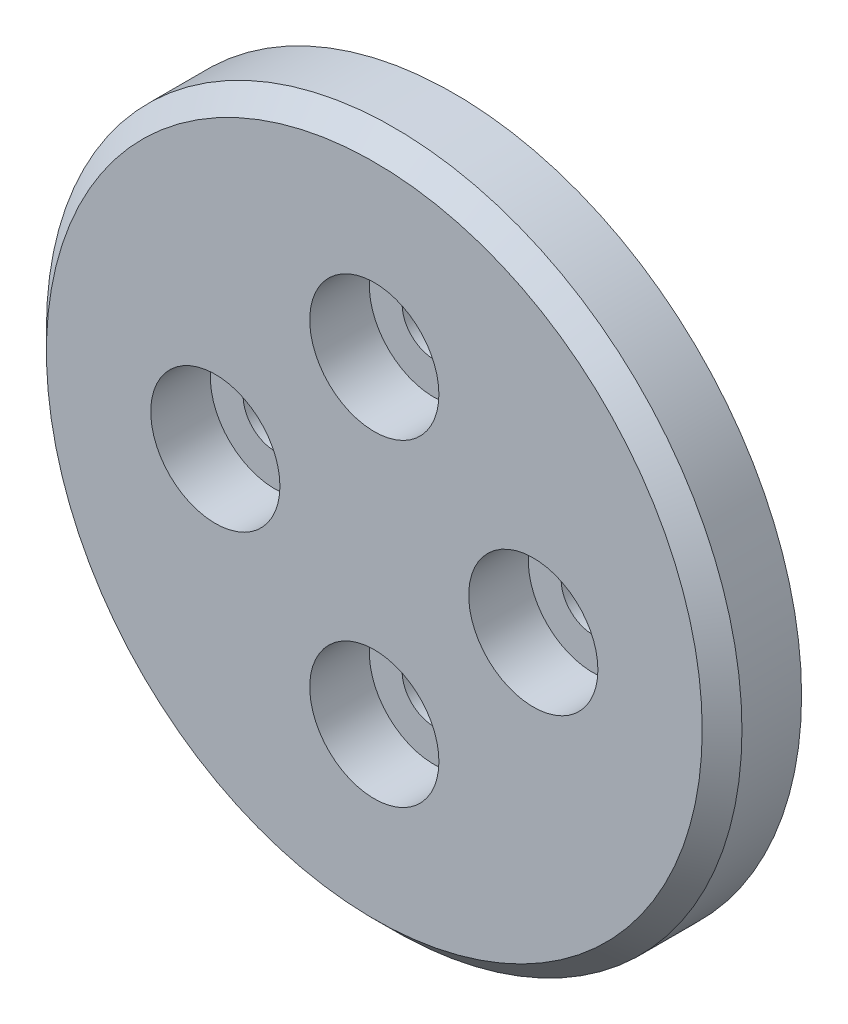
ISO-10303-21;
HEADER;
FILE_DESCRIPTION(('STEP AP214'),'2;1');
FILE_NAME('part.step','',(''),(''),'','','');
FILE_SCHEMA(('AUTOMOTIVE_DESIGN { 1 0 10303 214 1 1 1 1 }'));
ENDSEC;
DATA;
#1=APPLICATION_CONTEXT('core data for automotive mechanical design processes');
#2=APPLICATION_PROTOCOL_DEFINITION('international standard','automotive_design',2000,#1);
#3=PRODUCT_CONTEXT('',#1,'mechanical');
#4=PRODUCT('Part','Part','',(#3));
#5=PRODUCT_RELATED_PRODUCT_CATEGORY('part','',(#4));
#6=PRODUCT_DEFINITION_FORMATION('','',#4);
#7=PRODUCT_DEFINITION_CONTEXT('part definition',#1,'design');
#8=PRODUCT_DEFINITION('design','',#6,#7);
#9=PRODUCT_DEFINITION_SHAPE('','',#8);
#10=(LENGTH_UNIT() NAMED_UNIT(*) SI_UNIT(.MILLI.,.METRE.));
#11=(NAMED_UNIT(*) PLANE_ANGLE_UNIT() SI_UNIT($,.RADIAN.));
#12=(NAMED_UNIT(*) SI_UNIT($,.STERADIAN.) SOLID_ANGLE_UNIT());
#13=UNCERTAINTY_MEASURE_WITH_UNIT(LENGTH_MEASURE(1.E-05),#10,'distance_accuracy_value','');
#14=(GEOMETRIC_REPRESENTATION_CONTEXT(3) GLOBAL_UNCERTAINTY_ASSIGNED_CONTEXT((#13)) GLOBAL_UNIT_ASSIGNED_CONTEXT((#10,
#11,#12)) REPRESENTATION_CONTEXT('',''));
#15=CARTESIAN_POINT('',(0.,0.,0.));
#16=DIRECTION('',(0.,0.,1.));
#17=DIRECTION('',(1.,0.,0.));
#18=AXIS2_PLACEMENT_3D('',#15,#16,#17);
#19=CARTESIAN_POINT('',(0.,0.,4.));
#20=DIRECTION('',(0.,0.,-1.));
#21=DIRECTION('',(-1.,0.,0.));
#22=AXIS2_PLACEMENT_3D('',#19,#20,#21);
#23=CYLINDRICAL_SURFACE('',#22,17.5);
#24=CARTESIAN_POINT('',(0.,0.,3.));
#25=DIRECTION('',(0.,0.,1.));
#26=DIRECTION('',(1.,0.,0.));
#27=AXIS2_PLACEMENT_3D('',#24,#25,#26);
#28=CIRCLE('',#27,17.5);
#29=CARTESIAN_POINT('',(17.5,0.,3.));
#30=VERTEX_POINT('',#29);
#31=EDGE_CURVE('E10',#30,#30,#28,.F.);
#32=ORIENTED_EDGE('',*,*,#31,.T.);
#33=EDGE_LOOP('',(#32));
#34=FACE_BOUND('',#33,.T.);
#35=CARTESIAN_POINT('',(0.,0.,0.));
#36=DIRECTION('',(0.,0.,1.));
#37=DIRECTION('',(1.,0.,0.));
#38=AXIS2_PLACEMENT_3D('',#35,#36,#37);
#39=CIRCLE('',#38,17.5);
#40=CARTESIAN_POINT('',(17.5,0.,0.));
#41=VERTEX_POINT('',#40);
#42=EDGE_CURVE('E49',#41,#41,#39,.T.);
#43=ORIENTED_EDGE('',*,*,#42,.T.);
#44=EDGE_LOOP('',(#43));
#45=FACE_BOUND('',#44,.T.);
#46=ADVANCED_FACE('F33',(#34,#45),#23,.T.);
#47=CARTESIAN_POINT('',(0.,0.,4.));
#48=DIRECTION('',(0.,0.,1.));
#49=DIRECTION('',(1.,0.,0.));
#50=AXIS2_PLACEMENT_3D('',#47,#48,#49);
#51=PLANE('',#50);
#52=CARTESIAN_POINT('',(0.,0.,4.));
#53=DIRECTION('',(0.,0.,1.));
#54=DIRECTION('',(1.,0.,0.));
#55=AXIS2_PLACEMENT_3D('',#52,#53,#54);
#56=CIRCLE('',#55,16.5);
#57=CARTESIAN_POINT('',(16.5,0.,4.));
#58=VERTEX_POINT('',#57);
#59=EDGE_CURVE('E41',#58,#58,#56,.T.);
#60=ORIENTED_EDGE('',*,*,#59,.T.);
#61=EDGE_LOOP('',(#60));
#62=FACE_BOUND('',#61,.T.);
#63=CARTESIAN_POINT('',(0.,8.,4.));
#64=DIRECTION('',(0.,0.,1.));
#65=DIRECTION('',(1.,0.,0.));
#66=AXIS2_PLACEMENT_3D('',#63,#64,#65);
#67=CIRCLE('',#66,3.25);
#68=CARTESIAN_POINT('',(3.25,8.,4.));
#69=VERTEX_POINT('',#68);
#70=EDGE_CURVE('E102',#69,#69,#67,.T.);
#71=ORIENTED_EDGE('',*,*,#70,.F.);
#72=EDGE_LOOP('',(#71));
#73=FACE_BOUND('',#72,.T.);
#74=CARTESIAN_POINT('',(8.00000000000023,2.25918704863878E-13,4.));
#75=DIRECTION('',(0.,0.,1.));
#76=DIRECTION('',(1.,0.,0.));
#77=AXIS2_PLACEMENT_3D('',#74,#75,#76);
#78=CIRCLE('',#77,3.25);
#79=CARTESIAN_POINT('',(11.2500000000002,2.25918704863878E-13,4.));
#80=VERTEX_POINT('',#79);
#81=EDGE_CURVE('E90',#80,#80,#78,.T.);
#82=ORIENTED_EDGE('',*,*,#81,.F.);
#83=EDGE_LOOP('',(#82));
#84=FACE_BOUND('',#83,.T.);
#85=CARTESIAN_POINT('',(4.51837409727755E-13,-8.,4.));
#86=DIRECTION('',(0.,0.,1.));
#87=DIRECTION('',(1.,0.,0.));
#88=AXIS2_PLACEMENT_3D('',#85,#86,#87);
#89=CIRCLE('',#88,3.25);
#90=CARTESIAN_POINT('',(3.25000000000045,-8.,4.));
#91=VERTEX_POINT('',#90);
#92=EDGE_CURVE('E78',#91,#91,#89,.T.);
#93=ORIENTED_EDGE('',*,*,#92,.F.);
#94=EDGE_LOOP('',(#93));
#95=FACE_BOUND('',#94,.T.);
#96=CARTESIAN_POINT('',(-7.99999999999977,-2.2493898742456E-13,4.));
#97=DIRECTION('',(0.,0.,1.));
#98=DIRECTION('',(1.,0.,0.));
#99=AXIS2_PLACEMENT_3D('',#96,#97,#98);
#100=CIRCLE('',#99,3.25);
#101=CARTESIAN_POINT('',(-4.74999999999978,-2.2493898742456E-13,4.));
#102=VERTEX_POINT('',#101);
#103=EDGE_CURVE('E66',#102,#102,#100,.T.);
#104=ORIENTED_EDGE('',*,*,#103,.F.);
#105=EDGE_LOOP('',(#104));
#106=FACE_BOUND('',#105,.T.);
#107=ADVANCED_FACE('F108',(#62,#73,#84,#95,#106),#51,.T.);
#108=CARTESIAN_POINT('',(0.,0.,0.));
#109=DIRECTION('',(0.,0.,1.));
#110=DIRECTION('',(1.,0.,0.));
#111=AXIS2_PLACEMENT_3D('',#108,#109,#110);
#112=PLANE('',#111);
#113=CARTESIAN_POINT('',(0.,0.,0.));
#114=DIRECTION('',(0.,0.,-1.));
#115=DIRECTION('',(-1.,0.,0.));
#116=AXIS2_PLACEMENT_3D('',#113,#114,#115);
#117=CIRCLE('',#116,12.);
#118=CARTESIAN_POINT('',(-12.,0.,0.));
#119=VERTEX_POINT('',#118);
#120=EDGE_CURVE('E45',#119,#119,#117,.T.);
#121=ORIENTED_EDGE('',*,*,#120,.F.);
#122=EDGE_LOOP('',(#121));
#123=FACE_BOUND('',#122,.T.);
#124=ORIENTED_EDGE('',*,*,#42,.F.);
#125=EDGE_LOOP('',(#124));
#126=FACE_BOUND('',#125,.T.);
#127=ADVANCED_FACE('F111',(#123,#126),#112,.F.);
#128=CARTESIAN_POINT('',(0.,0.,-0.6));
#129=DIRECTION('',(0.,0.,1.));
#130=DIRECTION('',(1.,0.,0.));
#131=AXIS2_PLACEMENT_3D('',#128,#129,#130);
#132=CYLINDRICAL_SURFACE('',#131,12.);
#133=CARTESIAN_POINT('',(0.,0.,-0.6));
#134=DIRECTION('',(0.,0.,-1.));
#135=DIRECTION('',(-1.,0.,0.));
#136=AXIS2_PLACEMENT_3D('',#133,#134,#135);
#137=CIRCLE('',#136,12.);
#138=CARTESIAN_POINT('',(-12.,0.,-0.6));
#139=VERTEX_POINT('',#138);
#140=EDGE_CURVE('E53',#139,#139,#137,.T.);
#141=ORIENTED_EDGE('',*,*,#140,.F.);
#142=EDGE_LOOP('',(#141));
#143=FACE_BOUND('',#142,.T.);
#144=ORIENTED_EDGE('',*,*,#120,.T.);
#145=EDGE_LOOP('',(#144));
#146=FACE_BOUND('',#145,.T.);
#147=ADVANCED_FACE('F143',(#143,#146),#132,.T.);
#148=CARTESIAN_POINT('',(0.,0.,-0.6));
#149=DIRECTION('',(0.,0.,-1.));
#150=DIRECTION('',(-1.,0.,0.));
#151=AXIS2_PLACEMENT_3D('',#148,#149,#150);
#152=PLANE('',#151);
#153=CARTESIAN_POINT('',(0.,8.,-0.6));
#154=DIRECTION('',(0.,0.,1.));
#155=DIRECTION('',(1.,0.,0.));
#156=AXIS2_PLACEMENT_3D('',#153,#154,#155);
#157=CIRCLE('',#156,1.6);
#158=CARTESIAN_POINT('',(1.6,8.,-0.6));
#159=VERTEX_POINT('',#158);
#160=EDGE_CURVE('E93',#159,#159,#157,.T.);
#161=ORIENTED_EDGE('',*,*,#160,.T.);
#162=EDGE_LOOP('',(#161));
#163=FACE_BOUND('',#162,.T.);
#164=CARTESIAN_POINT('',(8.00000000000023,2.25918704863878E-13,-0.6));
#165=DIRECTION('',(0.,0.,1.));
#166=DIRECTION('',(1.,0.,0.));
#167=AXIS2_PLACEMENT_3D('',#164,#165,#166);
#168=CIRCLE('',#167,1.6);
#169=CARTESIAN_POINT('',(9.60000000000023,2.25918704863878E-13,-0.6));
#170=VERTEX_POINT('',#169);
#171=EDGE_CURVE('E81',#170,#170,#168,.T.);
#172=ORIENTED_EDGE('',*,*,#171,.T.);
#173=EDGE_LOOP('',(#172));
#174=FACE_BOUND('',#173,.T.);
#175=CARTESIAN_POINT('',(4.51837409727755E-13,-8.,-0.6));
#176=DIRECTION('',(0.,0.,1.));
#177=DIRECTION('',(1.,0.,0.));
#178=AXIS2_PLACEMENT_3D('',#175,#176,#177);
#179=CIRCLE('',#178,1.6);
#180=CARTESIAN_POINT('',(1.60000000000045,-8.,-0.6));
#181=VERTEX_POINT('',#180);
#182=EDGE_CURVE('E69',#181,#181,#179,.T.);
#183=ORIENTED_EDGE('',*,*,#182,.T.);
#184=EDGE_LOOP('',(#183));
#185=FACE_BOUND('',#184,.T.);
#186=CARTESIAN_POINT('',(-7.99999999999977,-2.2493898742456E-13,-0.6));
#187=DIRECTION('',(0.,0.,1.));
#188=DIRECTION('',(1.,0.,0.));
#189=AXIS2_PLACEMENT_3D('',#186,#187,#188);
#190=CIRCLE('',#189,1.6);
#191=CARTESIAN_POINT('',(-6.39999999999978,-2.2493898742456E-13,-0.6));
#192=VERTEX_POINT('',#191);
#193=EDGE_CURVE('E57',#192,#192,#190,.T.);
#194=ORIENTED_EDGE('',*,*,#193,.T.);
#195=EDGE_LOOP('',(#194));
#196=FACE_BOUND('',#195,.T.);
#197=ORIENTED_EDGE('',*,*,#140,.T.);
#198=EDGE_LOOP('',(#197));
#199=FACE_BOUND('',#198,.T.);
#200=ADVANCED_FACE('F148',(#163,#174,#185,#196,#199),#152,.T.);
#201=CARTESIAN_POINT('',(-7.99999999999977,-2.2493898742456E-13,4.));
#202=DIRECTION('',(0.,0.,1.));
#203=DIRECTION('',(1.,0.,0.));
#204=AXIS2_PLACEMENT_3D('',#201,#202,#203);
#205=CYLINDRICAL_SURFACE('',#204,1.6);
#206=ORIENTED_EDGE('',*,*,#193,.F.);
#207=EDGE_LOOP('',(#206));
#208=FACE_BOUND('',#207,.T.);
#209=CARTESIAN_POINT('',(-7.99999999999977,-2.2493898742456E-13,1.));
#210=DIRECTION('',(0.,0.,1.));
#211=DIRECTION('',(1.,0.,0.));
#212=AXIS2_PLACEMENT_3D('',#209,#210,#211);
#213=CIRCLE('',#212,1.6);
#214=CARTESIAN_POINT('',(-6.39999999999978,-2.2493898742456E-13,1.));
#215=VERTEX_POINT('',#214);
#216=EDGE_CURVE('E60',#215,#215,#213,.T.);
#217=ORIENTED_EDGE('',*,*,#216,.T.);
#218=EDGE_LOOP('',(#217));
#219=FACE_BOUND('',#218,.T.);
#220=ADVANCED_FACE('F132',(#208,#219),#205,.F.);
#221=CARTESIAN_POINT('',(-6.39999999999978,-2.2493898742456E-13,1.));
#222=DIRECTION('',(0.,0.,-1.));
#223=DIRECTION('',(-1.,0.,0.));
#224=AXIS2_PLACEMENT_3D('',#221,#222,#223);
#225=PLANE('',#224);
#226=ORIENTED_EDGE('',*,*,#216,.F.);
#227=EDGE_LOOP('',(#226));
#228=FACE_BOUND('',#227,.T.);
#229=CARTESIAN_POINT('',(-7.99999999999977,-2.2493898742456E-13,1.));
#230=DIRECTION('',(0.,0.,1.));
#231=DIRECTION('',(1.,0.,0.));
#232=AXIS2_PLACEMENT_3D('',#229,#230,#231);
#233=CIRCLE('',#232,3.25);
#234=CARTESIAN_POINT('',(-4.74999999999978,-2.2493898742456E-13,1.));
#235=VERTEX_POINT('',#234);
#236=EDGE_CURVE('E63',#235,#235,#233,.T.);
#237=ORIENTED_EDGE('',*,*,#236,.T.);
#238=EDGE_LOOP('',(#237));
#239=FACE_BOUND('',#238,.T.);
#240=ADVANCED_FACE('F122',(#228,#239),#225,.F.);
#241=CARTESIAN_POINT('',(-7.99999999999977,-2.2493898742456E-13,4.));
#242=DIRECTION('',(0.,0.,1.));
#243=DIRECTION('',(1.,0.,0.));
#244=AXIS2_PLACEMENT_3D('',#241,#242,#243);
#245=CYLINDRICAL_SURFACE('',#244,3.25);
#246=ORIENTED_EDGE('',*,*,#236,.F.);
#247=EDGE_LOOP('',(#246));
#248=FACE_BOUND('',#247,.T.);
#249=ORIENTED_EDGE('',*,*,#103,.T.);
#250=EDGE_LOOP('',(#249));
#251=FACE_BOUND('',#250,.T.);
#252=ADVANCED_FACE('F119',(#248,#251),#245,.F.);
#253=CARTESIAN_POINT('',(4.51837409727755E-13,-8.,4.));
#254=DIRECTION('',(0.,0.,1.));
#255=DIRECTION('',(1.,0.,0.));
#256=AXIS2_PLACEMENT_3D('',#253,#254,#255);
#257=CYLINDRICAL_SURFACE('',#256,1.6);
#258=ORIENTED_EDGE('',*,*,#182,.F.);
#259=EDGE_LOOP('',(#258));
#260=FACE_BOUND('',#259,.T.);
#261=CARTESIAN_POINT('',(4.51837409727755E-13,-8.,1.));
#262=DIRECTION('',(0.,0.,1.));
#263=DIRECTION('',(1.,0.,0.));
#264=AXIS2_PLACEMENT_3D('',#261,#262,#263);
#265=CIRCLE('',#264,1.6);
#266=CARTESIAN_POINT('',(1.60000000000045,-8.,1.));
#267=VERTEX_POINT('',#266);
#268=EDGE_CURVE('E72',#267,#267,#265,.T.);
#269=ORIENTED_EDGE('',*,*,#268,.T.);
#270=EDGE_LOOP('',(#269));
#271=FACE_BOUND('',#270,.T.);
#272=ADVANCED_FACE('F121',(#260,#271),#257,.F.);
#273=CARTESIAN_POINT('',(1.60000000000045,-8.,1.));
#274=DIRECTION('',(0.,0.,-1.));
#275=DIRECTION('',(-1.,0.,0.));
#276=AXIS2_PLACEMENT_3D('',#273,#274,#275);
#277=PLANE('',#276);
#278=ORIENTED_EDGE('',*,*,#268,.F.);
#279=EDGE_LOOP('',(#278));
#280=FACE_BOUND('',#279,.T.);
#281=CARTESIAN_POINT('',(4.51837409727755E-13,-8.,1.));
#282=DIRECTION('',(0.,0.,1.));
#283=DIRECTION('',(1.,0.,0.));
#284=AXIS2_PLACEMENT_3D('',#281,#282,#283);
#285=CIRCLE('',#284,3.25);
#286=CARTESIAN_POINT('',(3.25000000000045,-8.,1.));
#287=VERTEX_POINT('',#286);
#288=EDGE_CURVE('E75',#287,#287,#285,.T.);
#289=ORIENTED_EDGE('',*,*,#288,.T.);
#290=EDGE_LOOP('',(#289));
#291=FACE_BOUND('',#290,.T.);
#292=ADVANCED_FACE('F129',(#280,#291),#277,.F.);
#293=CARTESIAN_POINT('',(4.51837409727755E-13,-8.,4.));
#294=DIRECTION('',(0.,0.,1.));
#295=DIRECTION('',(1.,0.,0.));
#296=AXIS2_PLACEMENT_3D('',#293,#294,#295);
#297=CYLINDRICAL_SURFACE('',#296,3.25);
#298=ORIENTED_EDGE('',*,*,#288,.F.);
#299=EDGE_LOOP('',(#298));
#300=FACE_BOUND('',#299,.T.);
#301=ORIENTED_EDGE('',*,*,#92,.T.);
#302=EDGE_LOOP('',(#301));
#303=FACE_BOUND('',#302,.T.);
#304=ADVANCED_FACE('F194',(#300,#303),#297,.F.);
#305=CARTESIAN_POINT('',(8.00000000000023,2.25918704863878E-13,4.));
#306=DIRECTION('',(0.,0.,1.));
#307=DIRECTION('',(1.,0.,0.));
#308=AXIS2_PLACEMENT_3D('',#305,#306,#307);
#309=CYLINDRICAL_SURFACE('',#308,1.6);
#310=ORIENTED_EDGE('',*,*,#171,.F.);
#311=EDGE_LOOP('',(#310));
#312=FACE_BOUND('',#311,.T.);
#313=CARTESIAN_POINT('',(8.00000000000023,2.25918704863878E-13,1.));
#314=DIRECTION('',(0.,0.,1.));
#315=DIRECTION('',(1.,0.,0.));
#316=AXIS2_PLACEMENT_3D('',#313,#314,#315);
#317=CIRCLE('',#316,1.6);
#318=CARTESIAN_POINT('',(9.60000000000023,2.25918704863878E-13,1.));
#319=VERTEX_POINT('',#318);
#320=EDGE_CURVE('E84',#319,#319,#317,.T.);
#321=ORIENTED_EDGE('',*,*,#320,.T.);
#322=EDGE_LOOP('',(#321));
#323=FACE_BOUND('',#322,.T.);
#324=ADVANCED_FACE('F204',(#312,#323),#309,.F.);
#325=CARTESIAN_POINT('',(9.60000000000023,2.25918704863878E-13,1.));
#326=DIRECTION('',(0.,0.,-1.));
#327=DIRECTION('',(-1.,0.,0.));
#328=AXIS2_PLACEMENT_3D('',#325,#326,#327);
#329=PLANE('',#328);
#330=ORIENTED_EDGE('',*,*,#320,.F.);
#331=EDGE_LOOP('',(#330));
#332=FACE_BOUND('',#331,.T.);
#333=CARTESIAN_POINT('',(8.00000000000023,2.25918704863878E-13,1.));
#334=DIRECTION('',(0.,0.,1.));
#335=DIRECTION('',(1.,0.,0.));
#336=AXIS2_PLACEMENT_3D('',#333,#334,#335);
#337=CIRCLE('',#336,3.25);
#338=CARTESIAN_POINT('',(11.2500000000002,2.25918704863878E-13,1.));
#339=VERTEX_POINT('',#338);
#340=EDGE_CURVE('E87',#339,#339,#337,.T.);
#341=ORIENTED_EDGE('',*,*,#340,.T.);
#342=EDGE_LOOP('',(#341));
#343=FACE_BOUND('',#342,.T.);
#344=ADVANCED_FACE('F214',(#332,#343),#329,.F.);
#345=CARTESIAN_POINT('',(8.00000000000023,2.25918704863878E-13,4.));
#346=DIRECTION('',(0.,0.,1.));
#347=DIRECTION('',(1.,0.,0.));
#348=AXIS2_PLACEMENT_3D('',#345,#346,#347);
#349=CYLINDRICAL_SURFACE('',#348,3.25);
#350=ORIENTED_EDGE('',*,*,#340,.F.);
#351=EDGE_LOOP('',(#350));
#352=FACE_BOUND('',#351,.T.);
#353=ORIENTED_EDGE('',*,*,#81,.T.);
#354=EDGE_LOOP('',(#353));
#355=FACE_BOUND('',#354,.T.);
#356=ADVANCED_FACE('F224',(#352,#355),#349,.F.);
#357=CARTESIAN_POINT('',(0.,8.,4.));
#358=DIRECTION('',(0.,0.,1.));
#359=DIRECTION('',(1.,0.,0.));
#360=AXIS2_PLACEMENT_3D('',#357,#358,#359);
#361=CYLINDRICAL_SURFACE('',#360,1.6);
#362=ORIENTED_EDGE('',*,*,#160,.F.);
#363=EDGE_LOOP('',(#362));
#364=FACE_BOUND('',#363,.T.);
#365=CARTESIAN_POINT('',(0.,8.,1.));
#366=DIRECTION('',(0.,0.,1.));
#367=DIRECTION('',(1.,0.,0.));
#368=AXIS2_PLACEMENT_3D('',#365,#366,#367);
#369=CIRCLE('',#368,1.6);
#370=CARTESIAN_POINT('',(1.6,8.,1.));
#371=VERTEX_POINT('',#370);
#372=EDGE_CURVE('E96',#371,#371,#369,.T.);
#373=ORIENTED_EDGE('',*,*,#372,.T.);
#374=EDGE_LOOP('',(#373));
#375=FACE_BOUND('',#374,.T.);
#376=ADVANCED_FACE('F234',(#364,#375),#361,.F.);
#377=CARTESIAN_POINT('',(1.6,8.,1.));
#378=DIRECTION('',(0.,0.,-1.));
#379=DIRECTION('',(-1.,0.,0.));
#380=AXIS2_PLACEMENT_3D('',#377,#378,#379);
#381=PLANE('',#380);
#382=ORIENTED_EDGE('',*,*,#372,.F.);
#383=EDGE_LOOP('',(#382));
#384=FACE_BOUND('',#383,.T.);
#385=CARTESIAN_POINT('',(0.,8.,1.));
#386=DIRECTION('',(0.,0.,1.));
#387=DIRECTION('',(1.,0.,0.));
#388=AXIS2_PLACEMENT_3D('',#385,#386,#387);
#389=CIRCLE('',#388,3.25);
#390=CARTESIAN_POINT('',(3.25,8.,1.));
#391=VERTEX_POINT('',#390);
#392=EDGE_CURVE('E99',#391,#391,#389,.T.);
#393=ORIENTED_EDGE('',*,*,#392,.T.);
#394=EDGE_LOOP('',(#393));
#395=FACE_BOUND('',#394,.T.);
#396=ADVANCED_FACE('F244',(#384,#395),#381,.F.);
#397=CARTESIAN_POINT('',(0.,8.,4.));
#398=DIRECTION('',(0.,0.,1.));
#399=DIRECTION('',(1.,0.,0.));
#400=AXIS2_PLACEMENT_3D('',#397,#398,#399);
#401=CYLINDRICAL_SURFACE('',#400,3.25);
#402=ORIENTED_EDGE('',*,*,#392,.F.);
#403=EDGE_LOOP('',(#402));
#404=FACE_BOUND('',#403,.T.);
#405=ORIENTED_EDGE('',*,*,#70,.T.);
#406=EDGE_LOOP('',(#405));
#407=FACE_BOUND('',#406,.T.);
#408=ADVANCED_FACE('F106',(#404,#407),#401,.F.);
#409=CARTESIAN_POINT('',(0.,0.,4.));
#410=DIRECTION('',(0.,0.,-1.));
#411=DIRECTION('',(-1.,0.,0.));
#412=AXIS2_PLACEMENT_3D('',#409,#410,#411);
#413=CONICAL_SURFACE('',#412,16.5,0.785398163397445);
#414=ORIENTED_EDGE('',*,*,#31,.F.);
#415=EDGE_LOOP('',(#414));
#416=FACE_BOUND('',#415,.T.);
#417=ORIENTED_EDGE('',*,*,#59,.F.);
#418=EDGE_LOOP('',(#417));
#419=FACE_BOUND('',#418,.T.);
#420=ADVANCED_FACE('F36',(#416,#419),#413,.T.);
#421=CLOSED_SHELL('',(#46,#107,#127,#147,#200,#220,#240,#252,#272,#292,#304,#324,#344,#356,#376,
#396,#408,#420));
#422=MANIFOLD_SOLID_BREP('B2',#421);
#423=ADVANCED_BREP_SHAPE_REPRESENTATION('',(#18,#422),#14);
#424=SHAPE_DEFINITION_REPRESENTATION(#9,#423);
ENDSEC;
END-ISO-10303-21;
